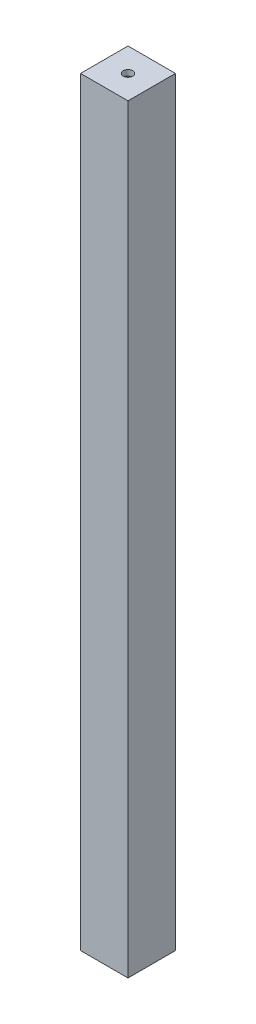
ISO-10303-21;
HEADER;
FILE_DESCRIPTION(('STEP AP214'),'2;1');
FILE_NAME('part.step','',(''),(''),'','','');
FILE_SCHEMA(('AUTOMOTIVE_DESIGN { 1 0 10303 214 1 1 1 1 }'));
ENDSEC;
DATA;
#1=APPLICATION_CONTEXT('core data for automotive mechanical design processes');
#2=APPLICATION_PROTOCOL_DEFINITION('international standard','automotive_design',2000,#1);
#3=PRODUCT_CONTEXT('',#1,'mechanical');
#4=PRODUCT('Part','Part','',(#3));
#5=PRODUCT_RELATED_PRODUCT_CATEGORY('part','',(#4));
#6=PRODUCT_DEFINITION_FORMATION('','',#4);
#7=PRODUCT_DEFINITION_CONTEXT('part definition',#1,'design');
#8=PRODUCT_DEFINITION('design','',#6,#7);
#9=PRODUCT_DEFINITION_SHAPE('','',#8);
#10=(LENGTH_UNIT() NAMED_UNIT(*) SI_UNIT(.MILLI.,.METRE.));
#11=(NAMED_UNIT(*) PLANE_ANGLE_UNIT() SI_UNIT($,.RADIAN.));
#12=(NAMED_UNIT(*) SI_UNIT($,.STERADIAN.) SOLID_ANGLE_UNIT());
#13=UNCERTAINTY_MEASURE_WITH_UNIT(LENGTH_MEASURE(1.E-05),#10,'distance_accuracy_value','');
#14=(GEOMETRIC_REPRESENTATION_CONTEXT(3) GLOBAL_UNCERTAINTY_ASSIGNED_CONTEXT((#13)) GLOBAL_UNIT_ASSIGNED_CONTEXT((#10,
#11,#12)) REPRESENTATION_CONTEXT('',''));
#15=CARTESIAN_POINT('',(0.,0.,0.));
#16=DIRECTION('',(0.,0.,1.));
#17=DIRECTION('',(1.,0.,0.));
#18=AXIS2_PLACEMENT_3D('',#15,#16,#17);
#19=CARTESIAN_POINT('',(9.5,400.,-12.5));
#20=DIRECTION('',(-1.,0.,0.));
#21=DIRECTION('',(0.,0.,1.));
#22=AXIS2_PLACEMENT_3D('',#19,#20,#21);
#23=PLANE('',#22);
#24=DIRECTION('',(0.,-1.,0.));
#25=VECTOR('',#24,1.);
#26=CARTESIAN_POINT('',(9.50000000000001,400.,9.5));
#27=LINE('',#26,#25);
#28=CARTESIAN_POINT('',(9.50000000000001,397.,9.5));
#29=VERTEX_POINT('',#28);
#30=CARTESIAN_POINT('',(9.50000000000001,0.,9.5));
#31=VERTEX_POINT('',#30);
#32=EDGE_CURVE('E118',#29,#31,#27,.T.);
#33=ORIENTED_EDGE('',*,*,#32,.F.);
#34=DIRECTION('',(0.,0.,-1.));
#35=VECTOR('',#34,1.);
#36=CARTESIAN_POINT('',(9.50000000000001,397.,9.5));
#37=LINE('',#36,#35);
#38=CARTESIAN_POINT('',(9.5,397.,-9.5));
#39=VERTEX_POINT('',#38);
#40=EDGE_CURVE('E48',#29,#39,#37,.T.);
#41=ORIENTED_EDGE('',*,*,#40,.T.);
#42=DIRECTION('',(0.,-1.,0.));
#43=VECTOR('',#42,1.);
#44=CARTESIAN_POINT('',(9.5,400.,-9.5));
#45=LINE('',#44,#43);
#46=CARTESIAN_POINT('',(9.5,0.,-9.5));
#47=VERTEX_POINT('',#46);
#48=EDGE_CURVE('E107',#39,#47,#45,.T.);
#49=ORIENTED_EDGE('',*,*,#48,.T.);
#50=DIRECTION('',(0.,0.,-1.));
#51=VECTOR('',#50,1.);
#52=CARTESIAN_POINT('',(9.5,0.,-12.5));
#53=LINE('',#52,#51);
#54=EDGE_CURVE('E122',#31,#47,#53,.T.);
#55=ORIENTED_EDGE('',*,*,#54,.F.);
#56=EDGE_LOOP('',(#33,#41,#49,#55));
#57=FACE_BOUND('',#56,.T.);
#58=ADVANCED_FACE('F33',(#57),#23,.T.);
#59=CARTESIAN_POINT('',(-12.5,400.,-9.5));
#60=DIRECTION('',(0.,0.,1.));
#61=DIRECTION('',(1.,0.,0.));
#62=AXIS2_PLACEMENT_3D('',#59,#60,#61);
#63=PLANE('',#62);
#64=ORIENTED_EDGE('',*,*,#48,.F.);
#65=DIRECTION('',(-1.,0.,0.));
#66=VECTOR('',#65,1.);
#67=CARTESIAN_POINT('',(9.5,397.,-9.5));
#68=LINE('',#67,#66);
#69=CARTESIAN_POINT('',(-9.5,397.,-9.5));
#70=VERTEX_POINT('',#69);
#71=EDGE_CURVE('E100',#39,#70,#68,.T.);
#72=ORIENTED_EDGE('',*,*,#71,.T.);
#73=DIRECTION('',(0.,-1.,0.));
#74=VECTOR('',#73,1.);
#75=CARTESIAN_POINT('',(-9.5,400.,-9.5));
#76=LINE('',#75,#74);
#77=CARTESIAN_POINT('',(-9.5,0.,-9.5));
#78=VERTEX_POINT('',#77);
#79=EDGE_CURVE('E56',#70,#78,#76,.T.);
#80=ORIENTED_EDGE('',*,*,#79,.T.);
#81=DIRECTION('',(-1.,0.,0.));
#82=VECTOR('',#81,1.);
#83=CARTESIAN_POINT('',(-12.5,0.,-9.5));
#84=LINE('',#83,#82);
#85=EDGE_CURVE('E125',#47,#78,#84,.T.);
#86=ORIENTED_EDGE('',*,*,#85,.F.);
#87=EDGE_LOOP('',(#64,#72,#80,#86));
#88=FACE_BOUND('',#87,.T.);
#89=ADVANCED_FACE('F106',(#88),#63,.T.);
#90=CARTESIAN_POINT('',(-9.5,400.,-12.5));
#91=DIRECTION('',(1.,0.,0.));
#92=DIRECTION('',(0.,0.,-1.));
#93=AXIS2_PLACEMENT_3D('',#90,#91,#92);
#94=PLANE('',#93);
#95=ORIENTED_EDGE('',*,*,#79,.F.);
#96=DIRECTION('',(0.,0.,1.));
#97=VECTOR('',#96,1.);
#98=CARTESIAN_POINT('',(-9.5,397.,-9.5));
#99=LINE('',#98,#97);
#100=CARTESIAN_POINT('',(-9.5,397.,9.5));
#101=VERTEX_POINT('',#100);
#102=EDGE_CURVE('E98',#70,#101,#99,.T.);
#103=ORIENTED_EDGE('',*,*,#102,.T.);
#104=DIRECTION('',(0.,-1.,0.));
#105=VECTOR('',#104,1.);
#106=CARTESIAN_POINT('',(-9.5,400.,9.5));
#107=LINE('',#106,#105);
#108=CARTESIAN_POINT('',(-9.5,0.,9.5));
#109=VERTEX_POINT('',#108);
#110=EDGE_CURVE('E114',#101,#109,#107,.T.);
#111=ORIENTED_EDGE('',*,*,#110,.T.);
#112=DIRECTION('',(0.,0.,1.));
#113=VECTOR('',#112,1.);
#114=CARTESIAN_POINT('',(-9.5,0.,-12.5));
#115=LINE('',#114,#113);
#116=EDGE_CURVE('E112',#78,#109,#115,.T.);
#117=ORIENTED_EDGE('',*,*,#116,.F.);
#118=EDGE_LOOP('',(#95,#103,#111,#117));
#119=FACE_BOUND('',#118,.T.);
#120=ADVANCED_FACE('F110',(#119),#94,.T.);
#121=CARTESIAN_POINT('',(-12.5,400.,9.5));
#122=DIRECTION('',(0.,0.,-1.));
#123=DIRECTION('',(-1.,0.,0.));
#124=AXIS2_PLACEMENT_3D('',#121,#122,#123);
#125=PLANE('',#124);
#126=ORIENTED_EDGE('',*,*,#110,.F.);
#127=DIRECTION('',(1.,0.,0.));
#128=VECTOR('',#127,1.);
#129=CARTESIAN_POINT('',(-9.5,397.,9.5));
#130=LINE('',#129,#128);
#131=EDGE_CURVE('E101',#101,#29,#130,.T.);
#132=ORIENTED_EDGE('',*,*,#131,.T.);
#133=ORIENTED_EDGE('',*,*,#32,.T.);
#134=DIRECTION('',(1.,0.,0.));
#135=VECTOR('',#134,1.);
#136=CARTESIAN_POINT('',(-12.5,0.,9.5));
#137=LINE('',#136,#135);
#138=EDGE_CURVE('E126',#109,#31,#137,.T.);
#139=ORIENTED_EDGE('',*,*,#138,.F.);
#140=EDGE_LOOP('',(#126,#132,#133,#139));
#141=FACE_BOUND('',#140,.T.);
#142=ADVANCED_FACE('F182',(#141),#125,.T.);
#143=CARTESIAN_POINT('',(12.5,400.,-12.5));
#144=DIRECTION('',(-1.,0.,0.));
#145=DIRECTION('',(0.,0.,1.));
#146=AXIS2_PLACEMENT_3D('',#143,#144,#145);
#147=PLANE('',#146);
#148=DIRECTION('',(0.,0.,-1.));
#149=VECTOR('',#148,1.);
#150=CARTESIAN_POINT('',(12.5,0.,-12.5));
#151=LINE('',#150,#149);
#152=CARTESIAN_POINT('',(12.5,0.,12.5));
#153=VERTEX_POINT('',#152);
#154=CARTESIAN_POINT('',(12.5,0.,-12.5));
#155=VERTEX_POINT('',#154);
#156=EDGE_CURVE('E116',#153,#155,#151,.T.);
#157=ORIENTED_EDGE('',*,*,#156,.T.);
#158=DIRECTION('',(0.,-1.,0.));
#159=VECTOR('',#158,1.);
#160=CARTESIAN_POINT('',(12.5,400.,-12.5));
#161=LINE('',#160,#159);
#162=CARTESIAN_POINT('',(12.5,400.,-12.5));
#163=VERTEX_POINT('',#162);
#164=EDGE_CURVE('E11',#163,#155,#161,.T.);
#165=ORIENTED_EDGE('',*,*,#164,.F.);
#166=DIRECTION('',(0.,0.,-1.));
#167=VECTOR('',#166,1.);
#168=CARTESIAN_POINT('',(12.5,400.,-12.5));
#169=LINE('',#168,#167);
#170=CARTESIAN_POINT('',(12.5,400.,12.5));
#171=VERTEX_POINT('',#170);
#172=EDGE_CURVE('E131',#171,#163,#169,.T.);
#173=ORIENTED_EDGE('',*,*,#172,.F.);
#174=DIRECTION('',(0.,-1.,0.));
#175=VECTOR('',#174,1.);
#176=CARTESIAN_POINT('',(12.5,400.,12.5));
#177=LINE('',#176,#175);
#178=EDGE_CURVE('E141',#171,#153,#177,.T.);
#179=ORIENTED_EDGE('',*,*,#178,.T.);
#180=EDGE_LOOP('',(#157,#165,#173,#179));
#181=FACE_BOUND('',#180,.T.);
#182=ADVANCED_FACE('F35',(#181),#147,.F.);
#183=CARTESIAN_POINT('',(-12.5,400.,-12.5));
#184=DIRECTION('',(0.,0.,1.));
#185=DIRECTION('',(1.,0.,0.));
#186=AXIS2_PLACEMENT_3D('',#183,#184,#185);
#187=PLANE('',#186);
#188=DIRECTION('',(-1.,0.,0.));
#189=VECTOR('',#188,1.);
#190=CARTESIAN_POINT('',(-12.5,0.,-12.5));
#191=LINE('',#190,#189);
#192=CARTESIAN_POINT('',(-12.5,0.,-12.5));
#193=VERTEX_POINT('',#192);
#194=EDGE_CURVE('E144',#155,#193,#191,.T.);
#195=ORIENTED_EDGE('',*,*,#194,.T.);
#196=DIRECTION('',(0.,-1.,0.));
#197=VECTOR('',#196,1.);
#198=CARTESIAN_POINT('',(-12.5,400.,-12.5));
#199=LINE('',#198,#197);
#200=CARTESIAN_POINT('',(-12.5,400.,-12.5));
#201=VERTEX_POINT('',#200);
#202=EDGE_CURVE('E41',#201,#193,#199,.T.);
#203=ORIENTED_EDGE('',*,*,#202,.F.);
#204=DIRECTION('',(-1.,0.,0.));
#205=VECTOR('',#204,1.);
#206=CARTESIAN_POINT('',(-12.5,400.,-12.5));
#207=LINE('',#206,#205);
#208=EDGE_CURVE('E134',#163,#201,#207,.T.);
#209=ORIENTED_EDGE('',*,*,#208,.F.);
#210=ORIENTED_EDGE('',*,*,#164,.T.);
#211=EDGE_LOOP('',(#195,#203,#209,#210));
#212=FACE_BOUND('',#211,.T.);
#213=ADVANCED_FACE('F175',(#212),#187,.F.);
#214=CARTESIAN_POINT('',(-12.5,400.,-12.5));
#215=DIRECTION('',(1.,0.,0.));
#216=DIRECTION('',(0.,0.,-1.));
#217=AXIS2_PLACEMENT_3D('',#214,#215,#216);
#218=PLANE('',#217);
#219=DIRECTION('',(0.,0.,1.));
#220=VECTOR('',#219,1.);
#221=CARTESIAN_POINT('',(-12.5,0.,-12.5));
#222=LINE('',#221,#220);
#223=CARTESIAN_POINT('',(-12.5,0.,12.5));
#224=VERTEX_POINT('',#223);
#225=EDGE_CURVE('E146',#193,#224,#222,.T.);
#226=ORIENTED_EDGE('',*,*,#225,.T.);
#227=DIRECTION('',(0.,-1.,0.));
#228=VECTOR('',#227,1.);
#229=CARTESIAN_POINT('',(-12.5,400.,12.5));
#230=LINE('',#229,#228);
#231=CARTESIAN_POINT('',(-12.5,400.,12.5));
#232=VERTEX_POINT('',#231);
#233=EDGE_CURVE('E151',#232,#224,#230,.T.);
#234=ORIENTED_EDGE('',*,*,#233,.F.);
#235=DIRECTION('',(0.,0.,1.));
#236=VECTOR('',#235,1.);
#237=CARTESIAN_POINT('',(-12.5,400.,-12.5));
#238=LINE('',#237,#236);
#239=EDGE_CURVE('E137',#201,#232,#238,.T.);
#240=ORIENTED_EDGE('',*,*,#239,.F.);
#241=ORIENTED_EDGE('',*,*,#202,.T.);
#242=EDGE_LOOP('',(#226,#234,#240,#241));
#243=FACE_BOUND('',#242,.T.);
#244=ADVANCED_FACE('F158',(#243),#218,.F.);
#245=CARTESIAN_POINT('',(-12.5,400.,12.5));
#246=DIRECTION('',(0.,0.,-1.));
#247=DIRECTION('',(-1.,0.,0.));
#248=AXIS2_PLACEMENT_3D('',#245,#246,#247);
#249=PLANE('',#248);
#250=DIRECTION('',(1.,0.,0.));
#251=VECTOR('',#250,1.);
#252=CARTESIAN_POINT('',(-12.5,0.,12.5));
#253=LINE('',#252,#251);
#254=EDGE_CURVE('E135',#224,#153,#253,.T.);
#255=ORIENTED_EDGE('',*,*,#254,.T.);
#256=ORIENTED_EDGE('',*,*,#178,.F.);
#257=DIRECTION('',(1.,0.,0.));
#258=VECTOR('',#257,1.);
#259=CARTESIAN_POINT('',(-12.5,400.,12.5));
#260=LINE('',#259,#258);
#261=EDGE_CURVE('E139',#232,#171,#260,.T.);
#262=ORIENTED_EDGE('',*,*,#261,.F.);
#263=ORIENTED_EDGE('',*,*,#233,.T.);
#264=EDGE_LOOP('',(#255,#256,#262,#263));
#265=FACE_BOUND('',#264,.T.);
#266=ADVANCED_FACE('F167',(#265),#249,.F.);
#267=CARTESIAN_POINT('',(0.,400.,0.));
#268=DIRECTION('',(0.,1.,0.));
#269=DIRECTION('',(0.,0.,1.));
#270=AXIS2_PLACEMENT_3D('',#267,#268,#269);
#271=PLANE('',#270);
#272=ORIENTED_EDGE('',*,*,#172,.T.);
#273=ORIENTED_EDGE('',*,*,#208,.T.);
#274=ORIENTED_EDGE('',*,*,#239,.T.);
#275=ORIENTED_EDGE('',*,*,#261,.T.);
#276=EDGE_LOOP('',(#272,#273,#274,#275));
#277=FACE_BOUND('',#276,.T.);
#278=CARTESIAN_POINT('',(0.,400.,0.));
#279=DIRECTION('',(0.,1.,0.));
#280=DIRECTION('',(0.,0.,1.));
#281=AXIS2_PLACEMENT_3D('',#278,#279,#280);
#282=CIRCLE('',#281,2.5);
#283=CARTESIAN_POINT('',(0.,400.,2.5));
#284=VERTEX_POINT('',#283);
#285=EDGE_CURVE('E286',#284,#284,#282,.T.);
#286=ORIENTED_EDGE('',*,*,#285,.F.);
#287=EDGE_LOOP('',(#286));
#288=FACE_BOUND('',#287,.T.);
#289=ADVANCED_FACE('F173',(#277,#288),#271,.T.);
#290=CARTESIAN_POINT('',(0.,0.,0.));
#291=DIRECTION('',(0.,1.,0.));
#292=DIRECTION('',(0.,0.,1.));
#293=AXIS2_PLACEMENT_3D('',#290,#291,#292);
#294=PLANE('',#293);
#295=ORIENTED_EDGE('',*,*,#138,.T.);
#296=ORIENTED_EDGE('',*,*,#54,.T.);
#297=ORIENTED_EDGE('',*,*,#85,.T.);
#298=ORIENTED_EDGE('',*,*,#116,.T.);
#299=EDGE_LOOP('',(#295,#296,#297,#298));
#300=FACE_BOUND('',#299,.T.);
#301=ORIENTED_EDGE('',*,*,#156,.F.);
#302=ORIENTED_EDGE('',*,*,#254,.F.);
#303=ORIENTED_EDGE('',*,*,#225,.F.);
#304=ORIENTED_EDGE('',*,*,#194,.F.);
#305=EDGE_LOOP('',(#301,#302,#303,#304));
#306=FACE_BOUND('',#305,.T.);
#307=ADVANCED_FACE('F164',(#300,#306),#294,.F.);
#308=CARTESIAN_POINT('',(0.,397.,0.));
#309=DIRECTION('',(0.,1.,0.));
#310=DIRECTION('',(0.,0.,1.));
#311=AXIS2_PLACEMENT_3D('',#308,#309,#310);
#312=PLANE('',#311);
#313=CARTESIAN_POINT('',(0.,397.,0.));
#314=DIRECTION('',(0.,1.,0.));
#315=DIRECTION('',(0.,0.,1.));
#316=AXIS2_PLACEMENT_3D('',#313,#314,#315);
#317=CIRCLE('',#316,2.5);
#318=CARTESIAN_POINT('',(0.,397.,2.5));
#319=VERTEX_POINT('',#318);
#320=EDGE_CURVE('E108',#319,#319,#317,.T.);
#321=ORIENTED_EDGE('',*,*,#320,.T.);
#322=EDGE_LOOP('',(#321));
#323=FACE_BOUND('',#322,.T.);
#324=ORIENTED_EDGE('',*,*,#71,.F.);
#325=ORIENTED_EDGE('',*,*,#40,.F.);
#326=ORIENTED_EDGE('',*,*,#131,.F.);
#327=ORIENTED_EDGE('',*,*,#102,.F.);
#328=EDGE_LOOP('',(#324,#325,#326,#327));
#329=FACE_BOUND('',#328,.T.);
#330=ADVANCED_FACE('F99',(#323,#329),#312,.F.);
#331=CARTESIAN_POINT('',(0.,397.,0.));
#332=DIRECTION('',(0.,1.,0.));
#333=DIRECTION('',(0.,0.,1.));
#334=AXIS2_PLACEMENT_3D('',#331,#332,#333);
#335=CYLINDRICAL_SURFACE('',#334,2.5);
#336=ORIENTED_EDGE('',*,*,#320,.F.);
#337=EDGE_LOOP('',(#336));
#338=FACE_BOUND('',#337,.T.);
#339=ORIENTED_EDGE('',*,*,#285,.T.);
#340=EDGE_LOOP('',(#339));
#341=FACE_BOUND('',#340,.T.);
#342=ADVANCED_FACE('F224',(#338,#341),#335,.F.);
#343=CLOSED_SHELL('',(#58,#89,#120,#142,#182,#213,#244,#266,#289,#307,#330,#342));
#344=MANIFOLD_SOLID_BREP('B2',#343);
#345=ADVANCED_BREP_SHAPE_REPRESENTATION('',(#18,#344),#14);
#346=SHAPE_DEFINITION_REPRESENTATION(#9,#345);
ENDSEC;
END-ISO-10303-21;
